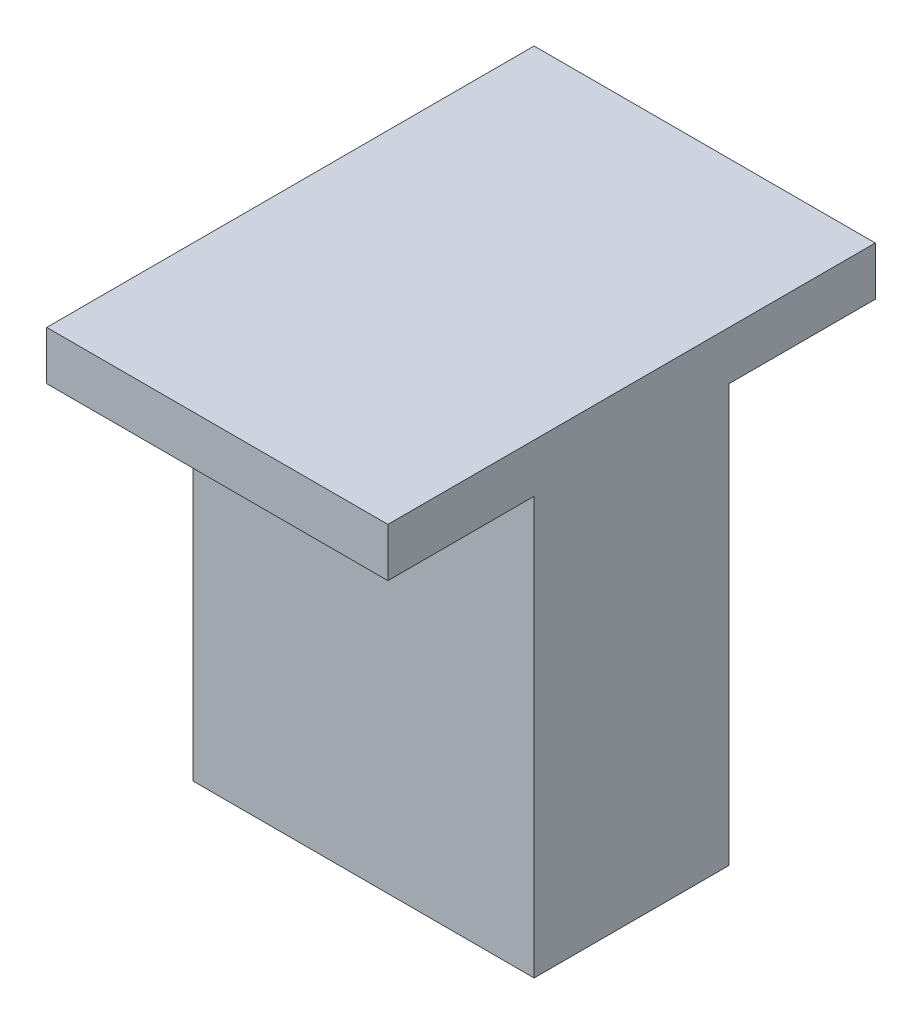
ISO-10303-21;
HEADER;
FILE_DESCRIPTION(('STEP AP214'),'2;1');
FILE_NAME('part.step','',(''),(''),'','','');
FILE_SCHEMA(('AUTOMOTIVE_DESIGN { 1 0 10303 214 1 1 1 1 }'));
ENDSEC;
DATA;
#1=APPLICATION_CONTEXT('core data for automotive mechanical design processes');
#2=APPLICATION_PROTOCOL_DEFINITION('international standard','automotive_design',2000,#1);
#3=PRODUCT_CONTEXT('',#1,'mechanical');
#4=PRODUCT('Part','Part','',(#3));
#5=PRODUCT_RELATED_PRODUCT_CATEGORY('part','',(#4));
#6=PRODUCT_DEFINITION_FORMATION('','',#4);
#7=PRODUCT_DEFINITION_CONTEXT('part definition',#1,'design');
#8=PRODUCT_DEFINITION('design','',#6,#7);
#9=PRODUCT_DEFINITION_SHAPE('','',#8);
#10=(LENGTH_UNIT() NAMED_UNIT(*) SI_UNIT(.MILLI.,.METRE.));
#11=(NAMED_UNIT(*) PLANE_ANGLE_UNIT() SI_UNIT($,.RADIAN.));
#12=(NAMED_UNIT(*) SI_UNIT($,.STERADIAN.) SOLID_ANGLE_UNIT());
#13=UNCERTAINTY_MEASURE_WITH_UNIT(LENGTH_MEASURE(1.E-05),#10,'distance_accuracy_value','');
#14=(GEOMETRIC_REPRESENTATION_CONTEXT(3) GLOBAL_UNCERTAINTY_ASSIGNED_CONTEXT((#13)) GLOBAL_UNIT_ASSIGNED_CONTEXT((#10,
#11,#12)) REPRESENTATION_CONTEXT('',''));
#15=CARTESIAN_POINT('',(0.,0.,0.));
#16=DIRECTION('',(0.,0.,1.));
#17=DIRECTION('',(1.,0.,0.));
#18=AXIS2_PLACEMENT_3D('',#15,#16,#17);
#19=CARTESIAN_POINT('',(17.5,47.8,-10.));
#20=DIRECTION('',(-1.,0.,0.));
#21=DIRECTION('',(0.,0.,1.));
#22=AXIS2_PLACEMENT_3D('',#19,#20,#21);
#23=PLANE('',#22);
#24=DIRECTION('',(0.,-1.,0.));
#25=VECTOR('',#24,1.);
#26=CARTESIAN_POINT('',(17.5,47.8,-10.));
#27=LINE('',#26,#25);
#28=CARTESIAN_POINT('',(17.5,42.8,-9.99999999999999));
#29=VERTEX_POINT('',#28);
#30=CARTESIAN_POINT('',(17.5,0.,-10.));
#31=VERTEX_POINT('',#30);
#32=EDGE_CURVE('E47',#29,#31,#27,.T.);
#33=ORIENTED_EDGE('',*,*,#32,.F.);
#34=DIRECTION('',(0.,0.,-1.));
#35=VECTOR('',#34,1.);
#36=CARTESIAN_POINT('',(17.5,42.8,25.));
#37=LINE('',#36,#35);
#38=CARTESIAN_POINT('',(17.5,42.8,-25.));
#39=VERTEX_POINT('',#38);
#40=EDGE_CURVE('E105',#29,#39,#37,.T.);
#41=ORIENTED_EDGE('',*,*,#40,.T.);
#42=DIRECTION('',(0.,1.,0.));
#43=VECTOR('',#42,1.);
#44=CARTESIAN_POINT('',(17.5,42.8,-25.));
#45=LINE('',#44,#43);
#46=CARTESIAN_POINT('',(17.5,47.8,-25.));
#47=VERTEX_POINT('',#46);
#48=EDGE_CURVE('E107',#39,#47,#45,.T.);
#49=ORIENTED_EDGE('',*,*,#48,.T.);
#50=DIRECTION('',(0.,0.,-1.));
#51=VECTOR('',#50,1.);
#52=CARTESIAN_POINT('',(17.5,47.8,-10.));
#53=LINE('',#52,#51);
#54=CARTESIAN_POINT('',(17.5,47.8,25.));
#55=VERTEX_POINT('',#54);
#56=EDGE_CURVE('E161',#55,#47,#53,.T.);
#57=ORIENTED_EDGE('',*,*,#56,.F.);
#58=DIRECTION('',(0.,1.,0.));
#59=VECTOR('',#58,1.);
#60=CARTESIAN_POINT('',(17.5,42.8,25.));
#61=LINE('',#60,#59);
#62=CARTESIAN_POINT('',(17.5,42.8,25.));
#63=VERTEX_POINT('',#62);
#64=EDGE_CURVE('E147',#63,#55,#61,.T.);
#65=ORIENTED_EDGE('',*,*,#64,.F.);
#66=CARTESIAN_POINT('',(17.5,42.8,9.99999999999999));
#67=VERTEX_POINT('',#66);
#68=EDGE_CURVE('E113',#63,#67,#37,.T.);
#69=ORIENTED_EDGE('',*,*,#68,.T.);
#70=DIRECTION('',(0.,-1.,0.));
#71=VECTOR('',#70,1.);
#72=CARTESIAN_POINT('',(17.5,47.8,9.99999999999999));
#73=LINE('',#72,#71);
#74=CARTESIAN_POINT('',(17.5,0.,9.99999999999999));
#75=VERTEX_POINT('',#74);
#76=EDGE_CURVE('E54',#67,#75,#73,.T.);
#77=ORIENTED_EDGE('',*,*,#76,.T.);
#78=DIRECTION('',(0.,0.,-1.));
#79=VECTOR('',#78,1.);
#80=CARTESIAN_POINT('',(17.5,0.,-10.));
#81=LINE('',#80,#79);
#82=EDGE_CURVE('E160',#75,#31,#81,.T.);
#83=ORIENTED_EDGE('',*,*,#82,.T.);
#84=EDGE_LOOP('',(#33,#41,#49,#57,#65,#69,#77,#83));
#85=FACE_BOUND('',#84,.T.);
#86=ADVANCED_FACE('F39',(#85),#23,.F.);
#87=CARTESIAN_POINT('',(-17.5,47.8,-10.));
#88=DIRECTION('',(0.,0.,1.));
#89=DIRECTION('',(1.,0.,0.));
#90=AXIS2_PLACEMENT_3D('',#87,#88,#89);
#91=PLANE('',#90);
#92=DIRECTION('',(0.,-1.,0.));
#93=VECTOR('',#92,1.);
#94=CARTESIAN_POINT('',(-17.5,47.8,-10.));
#95=LINE('',#94,#93);
#96=CARTESIAN_POINT('',(-17.5,42.8,-9.99999999999999));
#97=VERTEX_POINT('',#96);
#98=CARTESIAN_POINT('',(-17.5,0.,-10.));
#99=VERTEX_POINT('',#98);
#100=EDGE_CURVE('E183',#97,#99,#95,.T.);
#101=ORIENTED_EDGE('',*,*,#100,.F.);
#102=DIRECTION('',(1.,0.,0.));
#103=VECTOR('',#102,1.);
#104=CARTESIAN_POINT('',(-17.5,42.8,-10.));
#105=LINE('',#104,#103);
#106=EDGE_CURVE('E151',#97,#29,#105,.T.);
#107=ORIENTED_EDGE('',*,*,#106,.T.);
#108=ORIENTED_EDGE('',*,*,#32,.T.);
#109=DIRECTION('',(-1.,0.,0.));
#110=VECTOR('',#109,1.);
#111=CARTESIAN_POINT('',(-17.5,0.,-10.));
#112=LINE('',#111,#110);
#113=EDGE_CURVE('E170',#31,#99,#112,.T.);
#114=ORIENTED_EDGE('',*,*,#113,.T.);
#115=EDGE_LOOP('',(#101,#107,#108,#114));
#116=FACE_BOUND('',#115,.T.);
#117=ADVANCED_FACE('F189',(#116),#91,.F.);
#118=CARTESIAN_POINT('',(-17.5,47.8,-10.));
#119=DIRECTION('',(1.,0.,0.));
#120=DIRECTION('',(0.,0.,-1.));
#121=AXIS2_PLACEMENT_3D('',#118,#119,#120);
#122=PLANE('',#121);
#123=DIRECTION('',(0.,-1.,0.));
#124=VECTOR('',#123,1.);
#125=CARTESIAN_POINT('',(-17.5,47.8,9.99999999999999));
#126=LINE('',#125,#124);
#127=CARTESIAN_POINT('',(-17.5,42.8,9.99999999999999));
#128=VERTEX_POINT('',#127);
#129=CARTESIAN_POINT('',(-17.5,0.,9.99999999999999));
#130=VERTEX_POINT('',#129);
#131=EDGE_CURVE('E60',#128,#130,#126,.T.);
#132=ORIENTED_EDGE('',*,*,#131,.F.);
#133=DIRECTION('',(0.,0.,1.));
#134=VECTOR('',#133,1.);
#135=CARTESIAN_POINT('',(-17.5,42.8,25.));
#136=LINE('',#135,#134);
#137=CARTESIAN_POINT('',(-17.5,42.8,25.));
#138=VERTEX_POINT('',#137);
#139=EDGE_CURVE('E132',#128,#138,#136,.T.);
#140=ORIENTED_EDGE('',*,*,#139,.T.);
#141=DIRECTION('',(0.,1.,0.));
#142=VECTOR('',#141,1.);
#143=CARTESIAN_POINT('',(-17.5,42.8,25.));
#144=LINE('',#143,#142);
#145=CARTESIAN_POINT('',(-17.5,47.8,25.));
#146=VERTEX_POINT('',#145);
#147=EDGE_CURVE('E152',#138,#146,#144,.T.);
#148=ORIENTED_EDGE('',*,*,#147,.T.);
#149=DIRECTION('',(0.,0.,1.));
#150=VECTOR('',#149,1.);
#151=CARTESIAN_POINT('',(-17.5,47.8,-10.));
#152=LINE('',#151,#150);
#153=CARTESIAN_POINT('',(-17.5,47.8,-25.));
#154=VERTEX_POINT('',#153);
#155=EDGE_CURVE('E164',#154,#146,#152,.T.);
#156=ORIENTED_EDGE('',*,*,#155,.F.);
#157=DIRECTION('',(0.,1.,0.));
#158=VECTOR('',#157,1.);
#159=CARTESIAN_POINT('',(-17.5,42.8,-25.));
#160=LINE('',#159,#158);
#161=CARTESIAN_POINT('',(-17.5,42.8,-25.));
#162=VERTEX_POINT('',#161);
#163=EDGE_CURVE('E124',#162,#154,#160,.T.);
#164=ORIENTED_EDGE('',*,*,#163,.F.);
#165=EDGE_CURVE('E130',#162,#97,#136,.T.);
#166=ORIENTED_EDGE('',*,*,#165,.T.);
#167=ORIENTED_EDGE('',*,*,#100,.T.);
#168=DIRECTION('',(0.,0.,1.));
#169=VECTOR('',#168,1.);
#170=CARTESIAN_POINT('',(-17.5,0.,-10.));
#171=LINE('',#170,#169);
#172=EDGE_CURVE('E174',#99,#130,#171,.T.);
#173=ORIENTED_EDGE('',*,*,#172,.T.);
#174=EDGE_LOOP('',(#132,#140,#148,#156,#164,#166,#167,#173));
#175=FACE_BOUND('',#174,.T.);
#176=ADVANCED_FACE('F196',(#175),#122,.F.);
#177=CARTESIAN_POINT('',(-17.5,47.8,9.99999999999999));
#178=DIRECTION('',(0.,0.,-1.));
#179=DIRECTION('',(-1.,0.,0.));
#180=AXIS2_PLACEMENT_3D('',#177,#178,#179);
#181=PLANE('',#180);
#182=ORIENTED_EDGE('',*,*,#76,.F.);
#183=DIRECTION('',(-1.,0.,0.));
#184=VECTOR('',#183,1.);
#185=CARTESIAN_POINT('',(-17.5,42.8,9.99999999999999));
#186=LINE('',#185,#184);
#187=EDGE_CURVE('E11',#67,#128,#186,.T.);
#188=ORIENTED_EDGE('',*,*,#187,.T.);
#189=ORIENTED_EDGE('',*,*,#131,.T.);
#190=DIRECTION('',(1.,0.,0.));
#191=VECTOR('',#190,1.);
#192=CARTESIAN_POINT('',(-17.5,0.,9.99999999999999));
#193=LINE('',#192,#191);
#194=EDGE_CURVE('E165',#130,#75,#193,.T.);
#195=ORIENTED_EDGE('',*,*,#194,.T.);
#196=EDGE_LOOP('',(#182,#188,#189,#195));
#197=FACE_BOUND('',#196,.T.);
#198=ADVANCED_FACE('F207',(#197),#181,.F.);
#199=CARTESIAN_POINT('',(0.,47.8,0.));
#200=DIRECTION('',(0.,1.,0.));
#201=DIRECTION('',(0.,0.,1.));
#202=AXIS2_PLACEMENT_3D('',#199,#200,#201);
#203=PLANE('',#202);
#204=ORIENTED_EDGE('',*,*,#56,.T.);
#205=DIRECTION('',(-1.,0.,0.));
#206=VECTOR('',#205,1.);
#207=CARTESIAN_POINT('',(-17.5,47.8,-25.));
#208=LINE('',#207,#206);
#209=EDGE_CURVE('E122',#47,#154,#208,.T.);
#210=ORIENTED_EDGE('',*,*,#209,.T.);
#211=ORIENTED_EDGE('',*,*,#155,.T.);
#212=DIRECTION('',(1.,0.,0.));
#213=VECTOR('',#212,1.);
#214=CARTESIAN_POINT('',(-17.5,47.8,25.));
#215=LINE('',#214,#213);
#216=EDGE_CURVE('E114',#146,#55,#215,.T.);
#217=ORIENTED_EDGE('',*,*,#216,.T.);
#218=EDGE_LOOP('',(#204,#210,#211,#217));
#219=FACE_BOUND('',#218,.T.);
#220=ADVANCED_FACE('F198',(#219),#203,.T.);
#221=CARTESIAN_POINT('',(0.,0.,0.));
#222=DIRECTION('',(0.,1.,0.));
#223=DIRECTION('',(0.,0.,1.));
#224=AXIS2_PLACEMENT_3D('',#221,#222,#223);
#225=PLANE('',#224);
#226=ORIENTED_EDGE('',*,*,#82,.F.);
#227=ORIENTED_EDGE('',*,*,#194,.F.);
#228=ORIENTED_EDGE('',*,*,#172,.F.);
#229=ORIENTED_EDGE('',*,*,#113,.F.);
#230=EDGE_LOOP('',(#226,#227,#228,#229));
#231=FACE_BOUND('',#230,.T.);
#232=ADVANCED_FACE('F193',(#231),#225,.F.);
#233=CARTESIAN_POINT('',(-17.5,42.8,25.));
#234=DIRECTION('',(0.,0.,1.));
#235=DIRECTION('',(1.,0.,0.));
#236=AXIS2_PLACEMENT_3D('',#233,#234,#235);
#237=PLANE('',#236);
#238=ORIENTED_EDGE('',*,*,#216,.F.);
#239=ORIENTED_EDGE('',*,*,#147,.F.);
#240=DIRECTION('',(1.,0.,0.));
#241=VECTOR('',#240,1.);
#242=CARTESIAN_POINT('',(-17.5,42.8,25.));
#243=LINE('',#242,#241);
#244=EDGE_CURVE('E125',#138,#63,#243,.T.);
#245=ORIENTED_EDGE('',*,*,#244,.T.);
#246=ORIENTED_EDGE('',*,*,#64,.T.);
#247=EDGE_LOOP('',(#238,#239,#245,#246));
#248=FACE_BOUND('',#247,.T.);
#249=ADVANCED_FACE('F202',(#248),#237,.T.);
#250=CARTESIAN_POINT('',(0.,42.8,0.));
#251=DIRECTION('',(0.,-1.,0.));
#252=DIRECTION('',(0.,0.,-1.));
#253=AXIS2_PLACEMENT_3D('',#250,#251,#252);
#254=PLANE('',#253);
#255=ORIENTED_EDGE('',*,*,#187,.F.);
#256=ORIENTED_EDGE('',*,*,#68,.F.);
#257=ORIENTED_EDGE('',*,*,#244,.F.);
#258=ORIENTED_EDGE('',*,*,#139,.F.);
#259=EDGE_LOOP('',(#255,#256,#257,#258));
#260=FACE_BOUND('',#259,.T.);
#261=ADVANCED_FACE('F206',(#260),#254,.T.);
#262=ORIENTED_EDGE('',*,*,#106,.F.);
#263=ORIENTED_EDGE('',*,*,#165,.F.);
#264=DIRECTION('',(-1.,0.,0.));
#265=VECTOR('',#264,1.);
#266=CARTESIAN_POINT('',(-17.5,42.8,-25.));
#267=LINE('',#266,#265);
#268=EDGE_CURVE('E120',#39,#162,#267,.T.);
#269=ORIENTED_EDGE('',*,*,#268,.F.);
#270=ORIENTED_EDGE('',*,*,#40,.F.);
#271=EDGE_LOOP('',(#262,#263,#269,#270));
#272=FACE_BOUND('',#271,.T.);
#273=ADVANCED_FACE('F128',(#272),#254,.T.);
#274=CARTESIAN_POINT('',(-17.5,42.8,-25.));
#275=DIRECTION('',(0.,0.,-1.));
#276=DIRECTION('',(-1.,0.,0.));
#277=AXIS2_PLACEMENT_3D('',#274,#275,#276);
#278=PLANE('',#277);
#279=ORIENTED_EDGE('',*,*,#209,.F.);
#280=ORIENTED_EDGE('',*,*,#48,.F.);
#281=ORIENTED_EDGE('',*,*,#268,.T.);
#282=ORIENTED_EDGE('',*,*,#163,.T.);
#283=EDGE_LOOP('',(#279,#280,#281,#282));
#284=FACE_BOUND('',#283,.T.);
#285=ADVANCED_FACE('F118',(#284),#278,.T.);
#286=CLOSED_SHELL('',(#86,#117,#176,#198,#220,#232,#249,#261,#273,#285));
#287=MANIFOLD_SOLID_BREP('B2',#286);
#288=ADVANCED_BREP_SHAPE_REPRESENTATION('',(#18,#287),#14);
#289=SHAPE_DEFINITION_REPRESENTATION(#9,#288);
ENDSEC;
END-ISO-10303-21;
